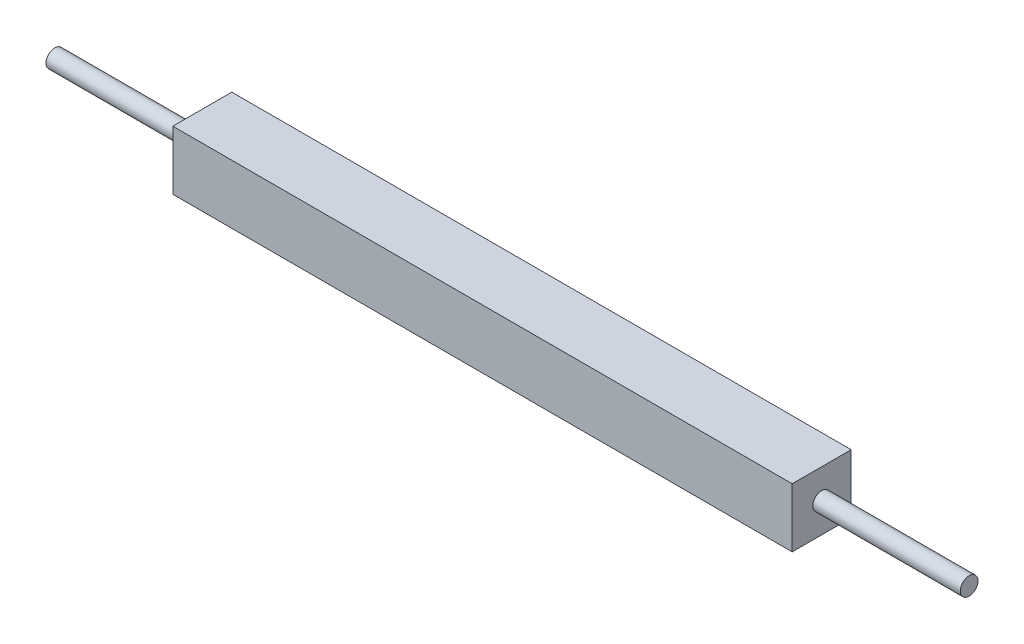
ISO-10303-21;
HEADER;
FILE_DESCRIPTION(('STEP AP214'),'2;1');
FILE_NAME('part.step','',(''),(''),'','','');
FILE_SCHEMA(('AUTOMOTIVE_DESIGN { 1 0 10303 214 1 1 1 1 }'));
ENDSEC;
DATA;
#1=APPLICATION_CONTEXT('core data for automotive mechanical design processes');
#2=APPLICATION_PROTOCOL_DEFINITION('international standard','automotive_design',2000,#1);
#3=PRODUCT_CONTEXT('',#1,'mechanical');
#4=PRODUCT('Part','Part','',(#3));
#5=PRODUCT_RELATED_PRODUCT_CATEGORY('part','',(#4));
#6=PRODUCT_DEFINITION_FORMATION('','',#4);
#7=PRODUCT_DEFINITION_CONTEXT('part definition',#1,'design');
#8=PRODUCT_DEFINITION('design','',#6,#7);
#9=PRODUCT_DEFINITION_SHAPE('','',#8);
#10=(LENGTH_UNIT() NAMED_UNIT(*) SI_UNIT(.MILLI.,.METRE.));
#11=(NAMED_UNIT(*) PLANE_ANGLE_UNIT() SI_UNIT($,.RADIAN.));
#12=(NAMED_UNIT(*) SI_UNIT($,.STERADIAN.) SOLID_ANGLE_UNIT());
#13=UNCERTAINTY_MEASURE_WITH_UNIT(LENGTH_MEASURE(1.E-05),#10,'distance_accuracy_value','');
#14=(GEOMETRIC_REPRESENTATION_CONTEXT(3) GLOBAL_UNCERTAINTY_ASSIGNED_CONTEXT((#13)) GLOBAL_UNIT_ASSIGNED_CONTEXT((#10,
#11,#12)) REPRESENTATION_CONTEXT('',''));
#15=CARTESIAN_POINT('',(0.,0.,0.));
#16=DIRECTION('',(0.,0.,1.));
#17=DIRECTION('',(1.,0.,0.));
#18=AXIS2_PLACEMENT_3D('',#15,#16,#17);
#19=CARTESIAN_POINT('',(-210.,-20.,40.));
#20=DIRECTION('',(1.,0.,0.));
#21=DIRECTION('',(0.,0.,-1.));
#22=AXIS2_PLACEMENT_3D('',#19,#20,#21);
#23=PLANE('',#22);
#24=DIRECTION('',(0.,-1.,0.));
#25=VECTOR('',#24,1.);
#26=CARTESIAN_POINT('',(-210.,-20.,0.));
#27=LINE('',#26,#25);
#28=CARTESIAN_POINT('',(-210.,20.,0.));
#29=VERTEX_POINT('',#28);
#30=CARTESIAN_POINT('',(-210.,-20.,0.));
#31=VERTEX_POINT('',#30);
#32=EDGE_CURVE('E78',#29,#31,#27,.T.);
#33=ORIENTED_EDGE('',*,*,#32,.T.);
#34=DIRECTION('',(0.,0.,-1.));
#35=VECTOR('',#34,1.);
#36=CARTESIAN_POINT('',(-210.,-20.,40.));
#37=LINE('',#36,#35);
#38=CARTESIAN_POINT('',(-210.,-20.,40.));
#39=VERTEX_POINT('',#38);
#40=EDGE_CURVE('E40',#39,#31,#37,.T.);
#41=ORIENTED_EDGE('',*,*,#40,.F.);
#42=DIRECTION('',(0.,-1.,0.));
#43=VECTOR('',#42,1.);
#44=CARTESIAN_POINT('',(-210.,-20.,40.));
#45=LINE('',#44,#43);
#46=CARTESIAN_POINT('',(-210.,20.,40.));
#47=VERTEX_POINT('',#46);
#48=EDGE_CURVE('E80',#47,#39,#45,.T.);
#49=ORIENTED_EDGE('',*,*,#48,.F.);
#50=DIRECTION('',(0.,0.,-1.));
#51=VECTOR('',#50,1.);
#52=CARTESIAN_POINT('',(-210.,20.,40.));
#53=LINE('',#52,#51);
#54=EDGE_CURVE('E111',#47,#29,#53,.T.);
#55=ORIENTED_EDGE('',*,*,#54,.T.);
#56=EDGE_LOOP('',(#33,#41,#49,#55));
#57=FACE_BOUND('',#56,.T.);
#58=CARTESIAN_POINT('',(-210.,0.,20.));
#59=DIRECTION('',(1.,0.,0.));
#60=DIRECTION('',(0.,0.,-1.));
#61=AXIS2_PLACEMENT_3D('',#58,#59,#60);
#62=CIRCLE('',#61,6.);
#63=CARTESIAN_POINT('',(-210.,0.,14.));
#64=VERTEX_POINT('',#63);
#65=EDGE_CURVE('E11',#64,#64,#62,.F.);
#66=ORIENTED_EDGE('',*,*,#65,.F.);
#67=EDGE_LOOP('',(#66));
#68=FACE_BOUND('',#67,.T.);
#69=ADVANCED_FACE('F32',(#57,#68),#23,.F.);
#70=CARTESIAN_POINT('',(-210.,-20.,40.));
#71=DIRECTION('',(0.,1.,0.));
#72=DIRECTION('',(0.,0.,1.));
#73=AXIS2_PLACEMENT_3D('',#70,#71,#72);
#74=PLANE('',#73);
#75=DIRECTION('',(1.,0.,0.));
#76=VECTOR('',#75,1.);
#77=CARTESIAN_POINT('',(-210.,-20.,0.));
#78=LINE('',#77,#76);
#79=CARTESIAN_POINT('',(210.,-20.,0.));
#80=VERTEX_POINT('',#79);
#81=EDGE_CURVE('E60',#31,#80,#78,.T.);
#82=ORIENTED_EDGE('',*,*,#81,.T.);
#83=DIRECTION('',(0.,0.,-1.));
#84=VECTOR('',#83,1.);
#85=CARTESIAN_POINT('',(210.,-20.,40.));
#86=LINE('',#85,#84);
#87=CARTESIAN_POINT('',(210.,-20.,40.));
#88=VERTEX_POINT('',#87);
#89=EDGE_CURVE('E87',#88,#80,#86,.T.);
#90=ORIENTED_EDGE('',*,*,#89,.F.);
#91=DIRECTION('',(1.,0.,0.));
#92=VECTOR('',#91,1.);
#93=CARTESIAN_POINT('',(-210.,-20.,40.));
#94=LINE('',#93,#92);
#95=EDGE_CURVE('E108',#39,#88,#94,.T.);
#96=ORIENTED_EDGE('',*,*,#95,.F.);
#97=ORIENTED_EDGE('',*,*,#40,.T.);
#98=EDGE_LOOP('',(#82,#90,#96,#97));
#99=FACE_BOUND('',#98,.T.);
#100=ADVANCED_FACE('F116',(#99),#74,.F.);
#101=CARTESIAN_POINT('',(-210.,20.,40.));
#102=DIRECTION('',(0.,-1.,0.));
#103=DIRECTION('',(0.,0.,-1.));
#104=AXIS2_PLACEMENT_3D('',#101,#102,#103);
#105=PLANE('',#104);
#106=DIRECTION('',(-1.,0.,0.));
#107=VECTOR('',#106,1.);
#108=CARTESIAN_POINT('',(-210.,20.,0.));
#109=LINE('',#108,#107);
#110=CARTESIAN_POINT('',(210.,20.,0.));
#111=VERTEX_POINT('',#110);
#112=EDGE_CURVE('E73',#111,#29,#109,.T.);
#113=ORIENTED_EDGE('',*,*,#112,.T.);
#114=ORIENTED_EDGE('',*,*,#54,.F.);
#115=DIRECTION('',(-1.,0.,0.));
#116=VECTOR('',#115,1.);
#117=CARTESIAN_POINT('',(-210.,20.,40.));
#118=LINE('',#117,#116);
#119=CARTESIAN_POINT('',(210.,20.,40.));
#120=VERTEX_POINT('',#119);
#121=EDGE_CURVE('E48',#120,#47,#118,.T.);
#122=ORIENTED_EDGE('',*,*,#121,.F.);
#123=DIRECTION('',(0.,0.,-1.));
#124=VECTOR('',#123,1.);
#125=CARTESIAN_POINT('',(210.,20.,40.));
#126=LINE('',#125,#124);
#127=EDGE_CURVE('E83',#120,#111,#126,.T.);
#128=ORIENTED_EDGE('',*,*,#127,.T.);
#129=EDGE_LOOP('',(#113,#114,#122,#128));
#130=FACE_BOUND('',#129,.T.);
#131=ADVANCED_FACE('F84',(#130),#105,.F.);
#132=CARTESIAN_POINT('',(0.,0.,40.));
#133=DIRECTION('',(0.,0.,-1.));
#134=DIRECTION('',(-1.,0.,0.));
#135=AXIS2_PLACEMENT_3D('',#132,#133,#134);
#136=PLANE('',#135);
#137=ORIENTED_EDGE('',*,*,#48,.T.);
#138=ORIENTED_EDGE('',*,*,#95,.T.);
#139=DIRECTION('',(0.,-1.,0.));
#140=VECTOR('',#139,1.);
#141=CARTESIAN_POINT('',(210.,-20.,40.));
#142=LINE('',#141,#140);
#143=EDGE_CURVE('E88',#120,#88,#142,.T.);
#144=ORIENTED_EDGE('',*,*,#143,.F.);
#145=ORIENTED_EDGE('',*,*,#121,.T.);
#146=EDGE_LOOP('',(#137,#138,#144,#145));
#147=FACE_BOUND('',#146,.T.);
#148=ADVANCED_FACE('F120',(#147),#136,.F.);
#149=CARTESIAN_POINT('',(0.,0.,0.));
#150=DIRECTION('',(0.,0.,-1.));
#151=DIRECTION('',(-1.,0.,0.));
#152=AXIS2_PLACEMENT_3D('',#149,#150,#151);
#153=PLANE('',#152);
#154=ORIENTED_EDGE('',*,*,#32,.F.);
#155=ORIENTED_EDGE('',*,*,#112,.F.);
#156=DIRECTION('',(0.,-1.,0.));
#157=VECTOR('',#156,1.);
#158=CARTESIAN_POINT('',(210.,-20.,0.));
#159=LINE('',#158,#157);
#160=EDGE_CURVE('E76',#111,#80,#159,.T.);
#161=ORIENTED_EDGE('',*,*,#160,.T.);
#162=ORIENTED_EDGE('',*,*,#81,.F.);
#163=EDGE_LOOP('',(#154,#155,#161,#162));
#164=FACE_BOUND('',#163,.T.);
#165=ADVANCED_FACE('F74',(#164),#153,.T.);
#166=CARTESIAN_POINT('',(-310.,0.,20.));
#167=DIRECTION('',(1.,0.,0.));
#168=DIRECTION('',(0.,0.,-1.));
#169=AXIS2_PLACEMENT_3D('',#166,#167,#168);
#170=CYLINDRICAL_SURFACE('',#169,6.);
#171=CARTESIAN_POINT('',(-310.,0.,20.));
#172=DIRECTION('',(-1.,0.,0.));
#173=DIRECTION('',(0.,0.,1.));
#174=AXIS2_PLACEMENT_3D('',#171,#172,#173);
#175=CIRCLE('',#174,6.);
#176=CARTESIAN_POINT('',(-310.,0.,26.));
#177=VERTEX_POINT('',#176);
#178=EDGE_CURVE('E104',#177,#177,#175,.T.);
#179=ORIENTED_EDGE('',*,*,#178,.F.);
#180=EDGE_LOOP('',(#179));
#181=FACE_BOUND('',#180,.T.);
#182=ORIENTED_EDGE('',*,*,#65,.T.);
#183=EDGE_LOOP('',(#182));
#184=FACE_BOUND('',#183,.T.);
#185=ADVANCED_FACE('F127',(#181,#184),#170,.T.);
#186=CARTESIAN_POINT('',(-310.,0.,20.));
#187=DIRECTION('',(-1.,0.,0.));
#188=DIRECTION('',(0.,0.,1.));
#189=AXIS2_PLACEMENT_3D('',#186,#187,#188);
#190=PLANE('',#189);
#191=ORIENTED_EDGE('',*,*,#178,.T.);
#192=EDGE_LOOP('',(#191));
#193=FACE_BOUND('',#192,.T.);
#194=ADVANCED_FACE('F166',(#193),#190,.T.);
#195=CARTESIAN_POINT('',(210.,-20.,40.));
#196=DIRECTION('',(-1.,0.,0.));
#197=DIRECTION('',(0.,0.,-1.));
#198=AXIS2_PLACEMENT_3D('',#195,#196,#197);
#199=PLANE('',#198);
#200=ORIENTED_EDGE('',*,*,#160,.F.);
#201=ORIENTED_EDGE('',*,*,#127,.F.);
#202=ORIENTED_EDGE('',*,*,#143,.T.);
#203=ORIENTED_EDGE('',*,*,#89,.T.);
#204=EDGE_LOOP('',(#200,#201,#202,#203));
#205=FACE_BOUND('',#204,.T.);
#206=CARTESIAN_POINT('',(210.,0.,20.));
#207=DIRECTION('',(1.,0.,0.));
#208=DIRECTION('',(0.,0.,-1.));
#209=AXIS2_PLACEMENT_3D('',#206,#207,#208);
#210=CIRCLE('',#209,6.);
#211=CARTESIAN_POINT('',(210.,0.,14.));
#212=VERTEX_POINT('',#211);
#213=EDGE_CURVE('E101',#212,#212,#210,.F.);
#214=ORIENTED_EDGE('',*,*,#213,.T.);
#215=EDGE_LOOP('',(#214));
#216=FACE_BOUND('',#215,.T.);
#217=ADVANCED_FACE('F91',(#205,#216),#199,.F.);
#218=CARTESIAN_POINT('',(310.,0.,20.));
#219=DIRECTION('',(-1.,0.,0.));
#220=DIRECTION('',(0.,0.,-1.));
#221=AXIS2_PLACEMENT_3D('',#218,#219,#220);
#222=CYLINDRICAL_SURFACE('',#221,6.);
#223=CARTESIAN_POINT('',(310.,0.,20.));
#224=DIRECTION('',(-1.,0.,0.));
#225=DIRECTION('',(0.,0.,1.));
#226=AXIS2_PLACEMENT_3D('',#223,#224,#225);
#227=CIRCLE('',#226,6.);
#228=CARTESIAN_POINT('',(310.,0.,26.));
#229=VERTEX_POINT('',#228);
#230=EDGE_CURVE('E94',#229,#229,#227,.T.);
#231=ORIENTED_EDGE('',*,*,#230,.T.);
#232=EDGE_LOOP('',(#231));
#233=FACE_BOUND('',#232,.T.);
#234=ORIENTED_EDGE('',*,*,#213,.F.);
#235=EDGE_LOOP('',(#234));
#236=FACE_BOUND('',#235,.T.);
#237=ADVANCED_FACE('F165',(#233,#236),#222,.T.);
#238=CARTESIAN_POINT('',(310.,0.,20.));
#239=DIRECTION('',(1.,0.,0.));
#240=DIRECTION('',(0.,0.,1.));
#241=AXIS2_PLACEMENT_3D('',#238,#239,#240);
#242=PLANE('',#241);
#243=ORIENTED_EDGE('',*,*,#230,.F.);
#244=EDGE_LOOP('',(#243));
#245=FACE_BOUND('',#244,.T.);
#246=ADVANCED_FACE('F176',(#245),#242,.T.);
#247=CLOSED_SHELL('',(#69,#100,#131,#148,#165,#185,#194,#217,#237,#246));
#248=MANIFOLD_SOLID_BREP('B2',#247);
#249=ADVANCED_BREP_SHAPE_REPRESENTATION('',(#18,#248),#14);
#250=SHAPE_DEFINITION_REPRESENTATION(#9,#249);
ENDSEC;
END-ISO-10303-21;
